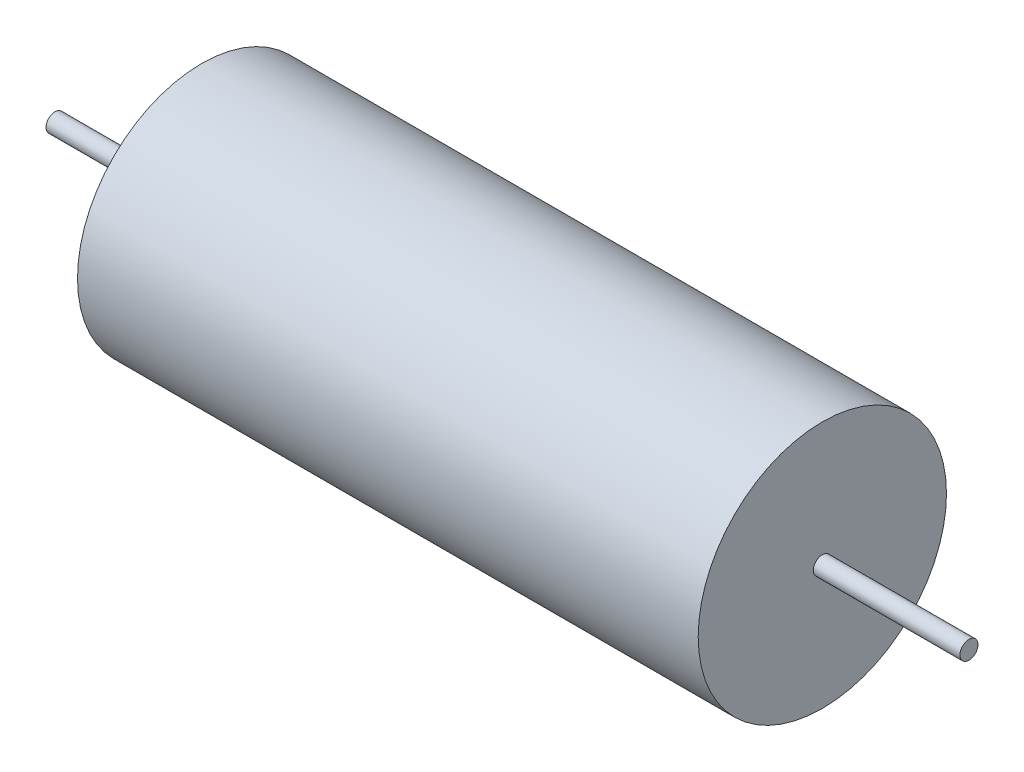
ISO-10303-21;
HEADER;
FILE_DESCRIPTION(('STEP AP214'),'2;1');
FILE_NAME('part.step','',(''),(''),'','','');
FILE_SCHEMA(('AUTOMOTIVE_DESIGN { 1 0 10303 214 1 1 1 1 }'));
ENDSEC;
DATA;
#1=APPLICATION_CONTEXT('core data for automotive mechanical design processes');
#2=APPLICATION_PROTOCOL_DEFINITION('international standard','automotive_design',2000,#1);
#3=PRODUCT_CONTEXT('',#1,'mechanical');
#4=PRODUCT('Part','Part','',(#3));
#5=PRODUCT_RELATED_PRODUCT_CATEGORY('part','',(#4));
#6=PRODUCT_DEFINITION_FORMATION('','',#4);
#7=PRODUCT_DEFINITION_CONTEXT('part definition',#1,'design');
#8=PRODUCT_DEFINITION('design','',#6,#7);
#9=PRODUCT_DEFINITION_SHAPE('','',#8);
#10=(LENGTH_UNIT() NAMED_UNIT(*) SI_UNIT(.MILLI.,.METRE.));
#11=(NAMED_UNIT(*) PLANE_ANGLE_UNIT() SI_UNIT($,.RADIAN.));
#12=(NAMED_UNIT(*) SI_UNIT($,.STERADIAN.) SOLID_ANGLE_UNIT());
#13=UNCERTAINTY_MEASURE_WITH_UNIT(LENGTH_MEASURE(1.E-05),#10,'distance_accuracy_value','');
#14=(GEOMETRIC_REPRESENTATION_CONTEXT(3) GLOBAL_UNCERTAINTY_ASSIGNED_CONTEXT((#13)) GLOBAL_UNIT_ASSIGNED_CONTEXT((#10,
#11,#12)) REPRESENTATION_CONTEXT('',''));
#15=CARTESIAN_POINT('',(0.,0.,0.));
#16=DIRECTION('',(0.,0.,1.));
#17=DIRECTION('',(1.,0.,0.));
#18=AXIS2_PLACEMENT_3D('',#15,#16,#17);
#19=CARTESIAN_POINT('',(-93.5,0.,0.));
#20=DIRECTION('',(-1.,0.,0.));
#21=DIRECTION('',(0.,0.,1.));
#22=AXIS2_PLACEMENT_3D('',#19,#20,#21);
#23=PLANE('',#22);
#24=CARTESIAN_POINT('',(-93.5,0.,0.));
#25=DIRECTION('',(1.,0.,0.));
#26=DIRECTION('',(0.,0.,-1.));
#27=AXIS2_PLACEMENT_3D('',#24,#25,#26);
#28=CIRCLE('',#27,1.85);
#29=CARTESIAN_POINT('',(-93.5,0.,-1.85));
#30=VERTEX_POINT('',#29);
#31=EDGE_CURVE('E10',#30,#30,#28,.T.);
#32=ORIENTED_EDGE('',*,*,#31,.F.);
#33=EDGE_LOOP('',(#32));
#34=FACE_BOUND('',#33,.T.);
#35=ADVANCED_FACE('F37',(#34),#23,.T.);
#36=CARTESIAN_POINT('',(93.5,0.,0.));
#37=DIRECTION('',(1.,0.,0.));
#38=DIRECTION('',(0.,0.,-1.));
#39=AXIS2_PLACEMENT_3D('',#36,#37,#38);
#40=CYLINDRICAL_SURFACE('',#39,1.85);
#41=ORIENTED_EDGE('',*,*,#31,.T.);
#42=EDGE_LOOP('',(#41));
#43=FACE_BOUND('',#42,.T.);
#44=CARTESIAN_POINT('',(-63.5,0.,0.));
#45=DIRECTION('',(1.,0.,0.));
#46=DIRECTION('',(0.,0.,-1.));
#47=AXIS2_PLACEMENT_3D('',#44,#45,#46);
#48=CIRCLE('',#47,1.85);
#49=CARTESIAN_POINT('',(-63.5,0.,-1.85));
#50=VERTEX_POINT('',#49);
#51=EDGE_CURVE('E43',#50,#50,#48,.T.);
#52=ORIENTED_EDGE('',*,*,#51,.F.);
#53=EDGE_LOOP('',(#52));
#54=FACE_BOUND('',#53,.T.);
#55=ADVANCED_FACE('F79',(#43,#54),#40,.T.);
#56=CARTESIAN_POINT('',(-63.5,1.85,0.));
#57=DIRECTION('',(-1.,0.,0.));
#58=DIRECTION('',(0.,0.,1.));
#59=AXIS2_PLACEMENT_3D('',#56,#57,#58);
#60=PLANE('',#59);
#61=ORIENTED_EDGE('',*,*,#51,.T.);
#62=EDGE_LOOP('',(#61));
#63=FACE_BOUND('',#62,.T.);
#64=CARTESIAN_POINT('',(-63.5,0.,0.));
#65=DIRECTION('',(1.,0.,0.));
#66=DIRECTION('',(0.,0.,-1.));
#67=AXIS2_PLACEMENT_3D('',#64,#65,#66);
#68=CIRCLE('',#67,25.4);
#69=CARTESIAN_POINT('',(-63.5,0.,-25.4));
#70=VERTEX_POINT('',#69);
#71=EDGE_CURVE('E47',#70,#70,#68,.T.);
#72=ORIENTED_EDGE('',*,*,#71,.F.);
#73=EDGE_LOOP('',(#72));
#74=FACE_BOUND('',#73,.T.);
#75=ADVANCED_FACE('F84',(#63,#74),#60,.T.);
#76=CARTESIAN_POINT('',(93.5,0.,0.));
#77=DIRECTION('',(1.,0.,0.));
#78=DIRECTION('',(0.,0.,-1.));
#79=AXIS2_PLACEMENT_3D('',#76,#77,#78);
#80=CYLINDRICAL_SURFACE('',#79,25.4);
#81=ORIENTED_EDGE('',*,*,#71,.T.);
#82=EDGE_LOOP('',(#81));
#83=FACE_BOUND('',#82,.T.);
#84=CARTESIAN_POINT('',(63.5,0.,0.));
#85=DIRECTION('',(1.,0.,0.));
#86=DIRECTION('',(0.,0.,-1.));
#87=AXIS2_PLACEMENT_3D('',#84,#85,#86);
#88=CIRCLE('',#87,25.4);
#89=CARTESIAN_POINT('',(63.5,0.,-25.4));
#90=VERTEX_POINT('',#89);
#91=EDGE_CURVE('E51',#90,#90,#88,.T.);
#92=ORIENTED_EDGE('',*,*,#91,.F.);
#93=EDGE_LOOP('',(#92));
#94=FACE_BOUND('',#93,.T.);
#95=ADVANCED_FACE('F75',(#83,#94),#80,.T.);
#96=CARTESIAN_POINT('',(63.5,25.4,0.));
#97=DIRECTION('',(1.,0.,0.));
#98=DIRECTION('',(0.,0.,-1.));
#99=AXIS2_PLACEMENT_3D('',#96,#97,#98);
#100=PLANE('',#99);
#101=ORIENTED_EDGE('',*,*,#91,.T.);
#102=EDGE_LOOP('',(#101));
#103=FACE_BOUND('',#102,.T.);
#104=CARTESIAN_POINT('',(63.5,0.,0.));
#105=DIRECTION('',(1.,0.,0.));
#106=DIRECTION('',(0.,0.,-1.));
#107=AXIS2_PLACEMENT_3D('',#104,#105,#106);
#108=CIRCLE('',#107,1.85);
#109=CARTESIAN_POINT('',(63.5,0.,-1.85));
#110=VERTEX_POINT('',#109);
#111=EDGE_CURVE('E56',#110,#110,#108,.T.);
#112=ORIENTED_EDGE('',*,*,#111,.F.);
#113=EDGE_LOOP('',(#112));
#114=FACE_BOUND('',#113,.T.);
#115=ADVANCED_FACE('F67',(#103,#114),#100,.T.);
#116=CARTESIAN_POINT('',(93.5,0.,0.));
#117=DIRECTION('',(1.,0.,0.));
#118=DIRECTION('',(0.,0.,-1.));
#119=AXIS2_PLACEMENT_3D('',#116,#117,#118);
#120=CYLINDRICAL_SURFACE('',#119,1.85);
#121=ORIENTED_EDGE('',*,*,#111,.T.);
#122=EDGE_LOOP('',(#121));
#123=FACE_BOUND('',#122,.T.);
#124=CARTESIAN_POINT('',(93.5,0.,0.));
#125=DIRECTION('',(1.,0.,0.));
#126=DIRECTION('',(0.,0.,-1.));
#127=AXIS2_PLACEMENT_3D('',#124,#125,#126);
#128=CIRCLE('',#127,1.85);
#129=CARTESIAN_POINT('',(93.5,0.,-1.85));
#130=VERTEX_POINT('',#129);
#131=EDGE_CURVE('E59',#130,#130,#128,.T.);
#132=ORIENTED_EDGE('',*,*,#131,.F.);
#133=EDGE_LOOP('',(#132));
#134=FACE_BOUND('',#133,.T.);
#135=ADVANCED_FACE('F65',(#123,#134),#120,.T.);
#136=CARTESIAN_POINT('',(93.5,1.85,0.));
#137=DIRECTION('',(1.,0.,0.));
#138=DIRECTION('',(0.,0.,-1.));
#139=AXIS2_PLACEMENT_3D('',#136,#137,#138);
#140=PLANE('',#139);
#141=ORIENTED_EDGE('',*,*,#131,.T.);
#142=EDGE_LOOP('',(#141));
#143=FACE_BOUND('',#142,.T.);
#144=ADVANCED_FACE('F63',(#143),#140,.T.);
#145=CLOSED_SHELL('',(#35,#55,#75,#95,#115,#135,#144));
#146=MANIFOLD_SOLID_BREP('B2',#145);
#147=ADVANCED_BREP_SHAPE_REPRESENTATION('',(#18,#146),#14);
#148=SHAPE_DEFINITION_REPRESENTATION(#9,#147);
ENDSEC;
END-ISO-10303-21;
